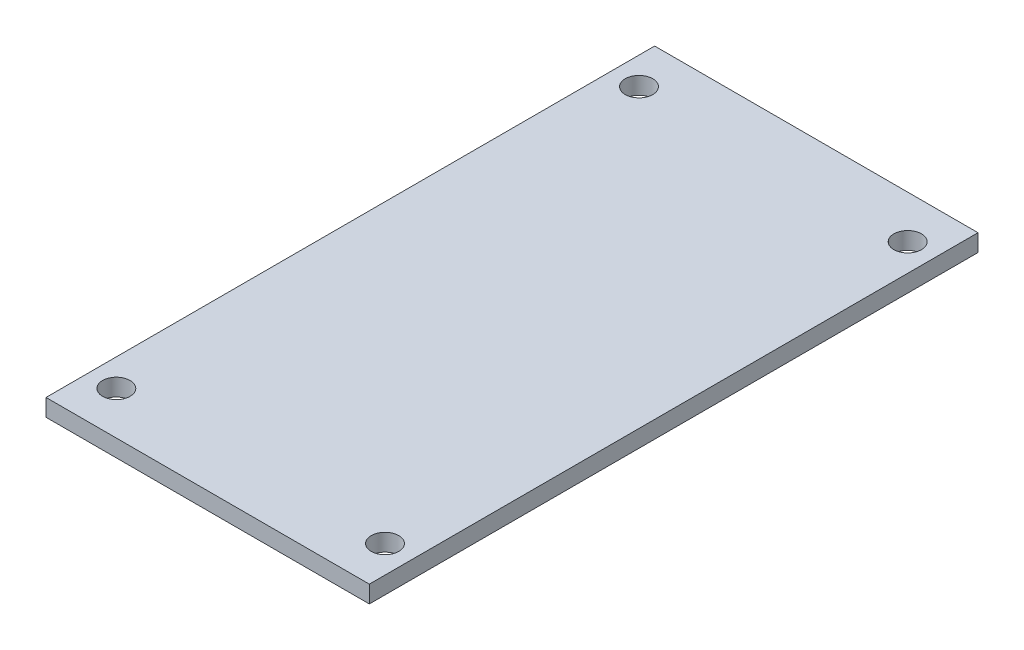
ISO-10303-21;
HEADER;
FILE_DESCRIPTION(('STEP AP214'),'2;1');
FILE_NAME('part.step','',(''),(''),'','','');
FILE_SCHEMA(('AUTOMOTIVE_DESIGN { 1 0 10303 214 1 1 1 1 }'));
ENDSEC;
DATA;
#1=APPLICATION_CONTEXT('core data for automotive mechanical design processes');
#2=APPLICATION_PROTOCOL_DEFINITION('international standard','automotive_design',2000,#1);
#3=PRODUCT_CONTEXT('',#1,'mechanical');
#4=PRODUCT('Part','Part','',(#3));
#5=PRODUCT_RELATED_PRODUCT_CATEGORY('part','',(#4));
#6=PRODUCT_DEFINITION_FORMATION('','',#4);
#7=PRODUCT_DEFINITION_CONTEXT('part definition',#1,'design');
#8=PRODUCT_DEFINITION('design','',#6,#7);
#9=PRODUCT_DEFINITION_SHAPE('','',#8);
#10=(LENGTH_UNIT() NAMED_UNIT(*) SI_UNIT(.MILLI.,.METRE.));
#11=(NAMED_UNIT(*) PLANE_ANGLE_UNIT() SI_UNIT($,.RADIAN.));
#12=(NAMED_UNIT(*) SI_UNIT($,.STERADIAN.) SOLID_ANGLE_UNIT());
#13=UNCERTAINTY_MEASURE_WITH_UNIT(LENGTH_MEASURE(1.E-05),#10,'distance_accuracy_value','');
#14=(GEOMETRIC_REPRESENTATION_CONTEXT(3) GLOBAL_UNCERTAINTY_ASSIGNED_CONTEXT((#13)) GLOBAL_UNIT_ASSIGNED_CONTEXT((#10,
#11,#12)) REPRESENTATION_CONTEXT('',''));
#15=CARTESIAN_POINT('',(0.,0.,0.));
#16=DIRECTION('',(0.,0.,1.));
#17=DIRECTION('',(1.,0.,0.));
#18=AXIS2_PLACEMENT_3D('',#15,#16,#17);
#19=CARTESIAN_POINT('',(0.,2.,0.));
#20=DIRECTION('',(0.,-1.,0.));
#21=DIRECTION('',(0.,0.,-1.));
#22=AXIS2_PLACEMENT_3D('',#19,#20,#21);
#23=PLANE('',#22);
#24=DIRECTION('',(0.,0.,-1.));
#25=VECTOR('',#24,1.);
#26=CARTESIAN_POINT('',(18.8,2.,35.39));
#27=LINE('',#26,#25);
#28=CARTESIAN_POINT('',(18.8,2.,35.39));
#29=VERTEX_POINT('',#28);
#30=CARTESIAN_POINT('',(18.8,2.,-35.39));
#31=VERTEX_POINT('',#30);
#32=EDGE_CURVE('E96',#29,#31,#27,.T.);
#33=ORIENTED_EDGE('',*,*,#32,.T.);
#34=DIRECTION('',(-1.,0.,0.));
#35=VECTOR('',#34,1.);
#36=CARTESIAN_POINT('',(-18.8,2.,-35.39));
#37=LINE('',#36,#35);
#38=CARTESIAN_POINT('',(-18.8,2.,-35.39));
#39=VERTEX_POINT('',#38);
#40=EDGE_CURVE('E91',#31,#39,#37,.T.);
#41=ORIENTED_EDGE('',*,*,#40,.T.);
#42=DIRECTION('',(0.,0.,1.));
#43=VECTOR('',#42,1.);
#44=CARTESIAN_POINT('',(-18.8,2.,35.39));
#45=LINE('',#44,#43);
#46=CARTESIAN_POINT('',(-18.8,2.,35.39));
#47=VERTEX_POINT('',#46);
#48=EDGE_CURVE('E94',#39,#47,#45,.T.);
#49=ORIENTED_EDGE('',*,*,#48,.T.);
#50=DIRECTION('',(1.,0.,0.));
#51=VECTOR('',#50,1.);
#52=CARTESIAN_POINT('',(-18.8,2.,35.39));
#53=LINE('',#52,#51);
#54=EDGE_CURVE('E61',#47,#29,#53,.T.);
#55=ORIENTED_EDGE('',*,*,#54,.T.);
#56=EDGE_LOOP('',(#33,#41,#49,#55));
#57=FACE_BOUND('',#56,.T.);
#58=CARTESIAN_POINT('',(15.62,2.,-30.39));
#59=DIRECTION('',(0.,1.,0.));
#60=DIRECTION('',(0.,0.,1.));
#61=AXIS2_PLACEMENT_3D('',#58,#59,#60);
#62=CIRCLE('',#61,1.6);
#63=CARTESIAN_POINT('',(15.62,2.,-28.79));
#64=VERTEX_POINT('',#63);
#65=EDGE_CURVE('E116',#64,#64,#62,.T.);
#66=ORIENTED_EDGE('',*,*,#65,.F.);
#67=EDGE_LOOP('',(#66));
#68=FACE_BOUND('',#67,.T.);
#69=CARTESIAN_POINT('',(15.62,2.,30.39));
#70=DIRECTION('',(0.,1.,0.));
#71=DIRECTION('',(0.,0.,-1.));
#72=AXIS2_PLACEMENT_3D('',#69,#70,#71);
#73=CIRCLE('',#72,1.6);
#74=CARTESIAN_POINT('',(15.62,2.,28.79));
#75=VERTEX_POINT('',#74);
#76=EDGE_CURVE('E138',#75,#75,#73,.T.);
#77=ORIENTED_EDGE('',*,*,#76,.F.);
#78=EDGE_LOOP('',(#77));
#79=FACE_BOUND('',#78,.T.);
#80=CARTESIAN_POINT('',(-15.62,2.,30.39));
#81=DIRECTION('',(0.,1.,0.));
#82=DIRECTION('',(0.,0.,1.));
#83=AXIS2_PLACEMENT_3D('',#80,#81,#82);
#84=CIRCLE('',#83,1.6);
#85=CARTESIAN_POINT('',(-15.62,2.,31.99));
#86=VERTEX_POINT('',#85);
#87=EDGE_CURVE('E146',#86,#86,#84,.T.);
#88=ORIENTED_EDGE('',*,*,#87,.F.);
#89=EDGE_LOOP('',(#88));
#90=FACE_BOUND('',#89,.T.);
#91=CARTESIAN_POINT('',(-15.62,2.,-30.39));
#92=DIRECTION('',(0.,1.,0.));
#93=DIRECTION('',(0.,0.,-1.));
#94=AXIS2_PLACEMENT_3D('',#91,#92,#93);
#95=CIRCLE('',#94,1.6);
#96=CARTESIAN_POINT('',(-15.62,2.,-31.99));
#97=VERTEX_POINT('',#96);
#98=EDGE_CURVE('E154',#97,#97,#95,.T.);
#99=ORIENTED_EDGE('',*,*,#98,.F.);
#100=EDGE_LOOP('',(#99));
#101=FACE_BOUND('',#100,.T.);
#102=ADVANCED_FACE('F43',(#57,#68,#79,#90,#101),#23,.F.);
#103=CARTESIAN_POINT('',(0.,0.,0.));
#104=DIRECTION('',(0.,-1.,0.));
#105=DIRECTION('',(0.,0.,-1.));
#106=AXIS2_PLACEMENT_3D('',#103,#104,#105);
#107=PLANE('',#106);
#108=CARTESIAN_POINT('',(-15.62,0.,30.39));
#109=DIRECTION('',(0.,1.,0.));
#110=DIRECTION('',(0.,0.,1.));
#111=AXIS2_PLACEMENT_3D('',#108,#109,#110);
#112=CIRCLE('',#111,1.6);
#113=CARTESIAN_POINT('',(-15.62,0.,31.99));
#114=VERTEX_POINT('',#113);
#115=EDGE_CURVE('E150',#114,#114,#112,.T.);
#116=ORIENTED_EDGE('',*,*,#115,.T.);
#117=EDGE_LOOP('',(#116));
#118=FACE_BOUND('',#117,.T.);
#119=CARTESIAN_POINT('',(15.62,0.,-30.39));
#120=DIRECTION('',(0.,1.,0.));
#121=DIRECTION('',(0.,0.,1.));
#122=AXIS2_PLACEMENT_3D('',#119,#120,#121);
#123=CIRCLE('',#122,1.6);
#124=CARTESIAN_POINT('',(15.62,0.,-28.79));
#125=VERTEX_POINT('',#124);
#126=EDGE_CURVE('E134',#125,#125,#123,.T.);
#127=ORIENTED_EDGE('',*,*,#126,.T.);
#128=EDGE_LOOP('',(#127));
#129=FACE_BOUND('',#128,.T.);
#130=DIRECTION('',(0.,0.,-1.));
#131=VECTOR('',#130,1.);
#132=CARTESIAN_POINT('',(18.8,0.,35.39));
#133=LINE('',#132,#131);
#134=CARTESIAN_POINT('',(18.8,0.,35.39));
#135=VERTEX_POINT('',#134);
#136=CARTESIAN_POINT('',(18.8,0.,-35.39));
#137=VERTEX_POINT('',#136);
#138=EDGE_CURVE('E112',#135,#137,#133,.T.);
#139=ORIENTED_EDGE('',*,*,#138,.F.);
#140=DIRECTION('',(1.,0.,0.));
#141=VECTOR('',#140,1.);
#142=CARTESIAN_POINT('',(-18.8,0.,35.39));
#143=LINE('',#142,#141);
#144=CARTESIAN_POINT('',(-18.8,0.,35.39));
#145=VERTEX_POINT('',#144);
#146=EDGE_CURVE('E84',#145,#135,#143,.T.);
#147=ORIENTED_EDGE('',*,*,#146,.F.);
#148=DIRECTION('',(0.,0.,1.));
#149=VECTOR('',#148,1.);
#150=CARTESIAN_POINT('',(-18.8,0.,35.39));
#151=LINE('',#150,#149);
#152=CARTESIAN_POINT('',(-18.8,0.,-35.39));
#153=VERTEX_POINT('',#152);
#154=EDGE_CURVE('E78',#153,#145,#151,.T.);
#155=ORIENTED_EDGE('',*,*,#154,.F.);
#156=DIRECTION('',(-1.,0.,0.));
#157=VECTOR('',#156,1.);
#158=CARTESIAN_POINT('',(-18.8,0.,-35.39));
#159=LINE('',#158,#157);
#160=EDGE_CURVE('E101',#137,#153,#159,.T.);
#161=ORIENTED_EDGE('',*,*,#160,.F.);
#162=EDGE_LOOP('',(#139,#147,#155,#161));
#163=FACE_BOUND('',#162,.T.);
#164=CARTESIAN_POINT('',(15.62,0.,30.39));
#165=DIRECTION('',(0.,1.,0.));
#166=DIRECTION('',(0.,0.,-1.));
#167=AXIS2_PLACEMENT_3D('',#164,#165,#166);
#168=CIRCLE('',#167,1.6);
#169=CARTESIAN_POINT('',(15.62,0.,28.79));
#170=VERTEX_POINT('',#169);
#171=EDGE_CURVE('E142',#170,#170,#168,.T.);
#172=ORIENTED_EDGE('',*,*,#171,.T.);
#173=EDGE_LOOP('',(#172));
#174=FACE_BOUND('',#173,.T.);
#175=CARTESIAN_POINT('',(-15.62,0.,-30.39));
#176=DIRECTION('',(0.,1.,0.));
#177=DIRECTION('',(0.,0.,-1.));
#178=AXIS2_PLACEMENT_3D('',#175,#176,#177);
#179=CIRCLE('',#178,1.6);
#180=CARTESIAN_POINT('',(-15.62,0.,-31.99));
#181=VERTEX_POINT('',#180);
#182=EDGE_CURVE('E158',#181,#181,#179,.T.);
#183=ORIENTED_EDGE('',*,*,#182,.T.);
#184=EDGE_LOOP('',(#183));
#185=FACE_BOUND('',#184,.T.);
#186=ADVANCED_FACE('F129',(#118,#129,#163,#174,#185),#107,.T.);
#187=CARTESIAN_POINT('',(18.8,2.,35.39));
#188=DIRECTION('',(-1.,0.,0.));
#189=DIRECTION('',(0.,0.,1.));
#190=AXIS2_PLACEMENT_3D('',#187,#188,#189);
#191=PLANE('',#190);
#192=ORIENTED_EDGE('',*,*,#138,.T.);
#193=DIRECTION('',(0.,-1.,0.));
#194=VECTOR('',#193,1.);
#195=CARTESIAN_POINT('',(18.8,2.,-35.39));
#196=LINE('',#195,#194);
#197=EDGE_CURVE('E11',#31,#137,#196,.T.);
#198=ORIENTED_EDGE('',*,*,#197,.F.);
#199=ORIENTED_EDGE('',*,*,#32,.F.);
#200=DIRECTION('',(0.,-1.,0.));
#201=VECTOR('',#200,1.);
#202=CARTESIAN_POINT('',(18.8,2.,35.39));
#203=LINE('',#202,#201);
#204=EDGE_CURVE('E108',#29,#135,#203,.T.);
#205=ORIENTED_EDGE('',*,*,#204,.T.);
#206=EDGE_LOOP('',(#192,#198,#199,#205));
#207=FACE_BOUND('',#206,.T.);
#208=ADVANCED_FACE('F45',(#207),#191,.F.);
#209=CARTESIAN_POINT('',(-18.8,2.,-35.39));
#210=DIRECTION('',(0.,0.,1.));
#211=DIRECTION('',(1.,0.,0.));
#212=AXIS2_PLACEMENT_3D('',#209,#210,#211);
#213=PLANE('',#212);
#214=ORIENTED_EDGE('',*,*,#160,.T.);
#215=DIRECTION('',(0.,-1.,0.));
#216=VECTOR('',#215,1.);
#217=CARTESIAN_POINT('',(-18.8,2.,-35.39));
#218=LINE('',#217,#216);
#219=EDGE_CURVE('E53',#39,#153,#218,.T.);
#220=ORIENTED_EDGE('',*,*,#219,.F.);
#221=ORIENTED_EDGE('',*,*,#40,.F.);
#222=ORIENTED_EDGE('',*,*,#197,.T.);
#223=EDGE_LOOP('',(#214,#220,#221,#222));
#224=FACE_BOUND('',#223,.T.);
#225=ADVANCED_FACE('F100',(#224),#213,.F.);
#226=CARTESIAN_POINT('',(-18.8,2.,35.39));
#227=DIRECTION('',(1.,0.,0.));
#228=DIRECTION('',(0.,0.,-1.));
#229=AXIS2_PLACEMENT_3D('',#226,#227,#228);
#230=PLANE('',#229);
#231=ORIENTED_EDGE('',*,*,#154,.T.);
#232=DIRECTION('',(0.,-1.,0.));
#233=VECTOR('',#232,1.);
#234=CARTESIAN_POINT('',(-18.8,2.,35.39));
#235=LINE('',#234,#233);
#236=EDGE_CURVE('E103',#47,#145,#235,.T.);
#237=ORIENTED_EDGE('',*,*,#236,.F.);
#238=ORIENTED_EDGE('',*,*,#48,.F.);
#239=ORIENTED_EDGE('',*,*,#219,.T.);
#240=EDGE_LOOP('',(#231,#237,#238,#239));
#241=FACE_BOUND('',#240,.T.);
#242=ADVANCED_FACE('F104',(#241),#230,.F.);
#243=CARTESIAN_POINT('',(-18.8,2.,35.39));
#244=DIRECTION('',(0.,0.,-1.));
#245=DIRECTION('',(-1.,0.,0.));
#246=AXIS2_PLACEMENT_3D('',#243,#244,#245);
#247=PLANE('',#246);
#248=ORIENTED_EDGE('',*,*,#146,.T.);
#249=ORIENTED_EDGE('',*,*,#204,.F.);
#250=ORIENTED_EDGE('',*,*,#54,.F.);
#251=ORIENTED_EDGE('',*,*,#236,.T.);
#252=EDGE_LOOP('',(#248,#249,#250,#251));
#253=FACE_BOUND('',#252,.T.);
#254=ADVANCED_FACE('F126',(#253),#247,.F.);
#255=CARTESIAN_POINT('',(15.62,2.,-30.39));
#256=DIRECTION('',(0.,-1.,0.));
#257=DIRECTION('',(0.,0.,-1.));
#258=AXIS2_PLACEMENT_3D('',#255,#256,#257);
#259=CYLINDRICAL_SURFACE('',#258,1.6);
#260=ORIENTED_EDGE('',*,*,#65,.T.);
#261=EDGE_LOOP('',(#260));
#262=FACE_BOUND('',#261,.T.);
#263=ORIENTED_EDGE('',*,*,#126,.F.);
#264=EDGE_LOOP('',(#263));
#265=FACE_BOUND('',#264,.T.);
#266=ADVANCED_FACE('F177',(#262,#265),#259,.F.);
#267=CARTESIAN_POINT('',(15.62,2.,30.39));
#268=DIRECTION('',(0.,-1.,0.));
#269=DIRECTION('',(0.,0.,-1.));
#270=AXIS2_PLACEMENT_3D('',#267,#268,#269);
#271=CYLINDRICAL_SURFACE('',#270,1.6);
#272=ORIENTED_EDGE('',*,*,#76,.T.);
#273=EDGE_LOOP('',(#272));
#274=FACE_BOUND('',#273,.T.);
#275=ORIENTED_EDGE('',*,*,#171,.F.);
#276=EDGE_LOOP('',(#275));
#277=FACE_BOUND('',#276,.T.);
#278=ADVANCED_FACE('F231',(#274,#277),#271,.F.);
#279=CARTESIAN_POINT('',(-15.62,2.,30.39));
#280=DIRECTION('',(0.,-1.,0.));
#281=DIRECTION('',(0.,0.,-1.));
#282=AXIS2_PLACEMENT_3D('',#279,#280,#281);
#283=CYLINDRICAL_SURFACE('',#282,1.6);
#284=ORIENTED_EDGE('',*,*,#87,.T.);
#285=EDGE_LOOP('',(#284));
#286=FACE_BOUND('',#285,.T.);
#287=ORIENTED_EDGE('',*,*,#115,.F.);
#288=EDGE_LOOP('',(#287));
#289=FACE_BOUND('',#288,.T.);
#290=ADVANCED_FACE('F240',(#286,#289),#283,.F.);
#291=CARTESIAN_POINT('',(-15.62,2.,-30.39));
#292=DIRECTION('',(0.,-1.,0.));
#293=DIRECTION('',(0.,0.,-1.));
#294=AXIS2_PLACEMENT_3D('',#291,#292,#293);
#295=CYLINDRICAL_SURFACE('',#294,1.6);
#296=ORIENTED_EDGE('',*,*,#98,.T.);
#297=EDGE_LOOP('',(#296));
#298=FACE_BOUND('',#297,.T.);
#299=ORIENTED_EDGE('',*,*,#182,.F.);
#300=EDGE_LOOP('',(#299));
#301=FACE_BOUND('',#300,.T.);
#302=ADVANCED_FACE('F166',(#298,#301),#295,.F.);
#303=CLOSED_SHELL('',(#102,#186,#208,#225,#242,#254,#266,#278,#290,#302));
#304=MANIFOLD_SOLID_BREP('B2',#303);
#305=ADVANCED_BREP_SHAPE_REPRESENTATION('',(#18,#304),#14);
#306=SHAPE_DEFINITION_REPRESENTATION(#9,#305);
ENDSEC;
END-ISO-10303-21;
